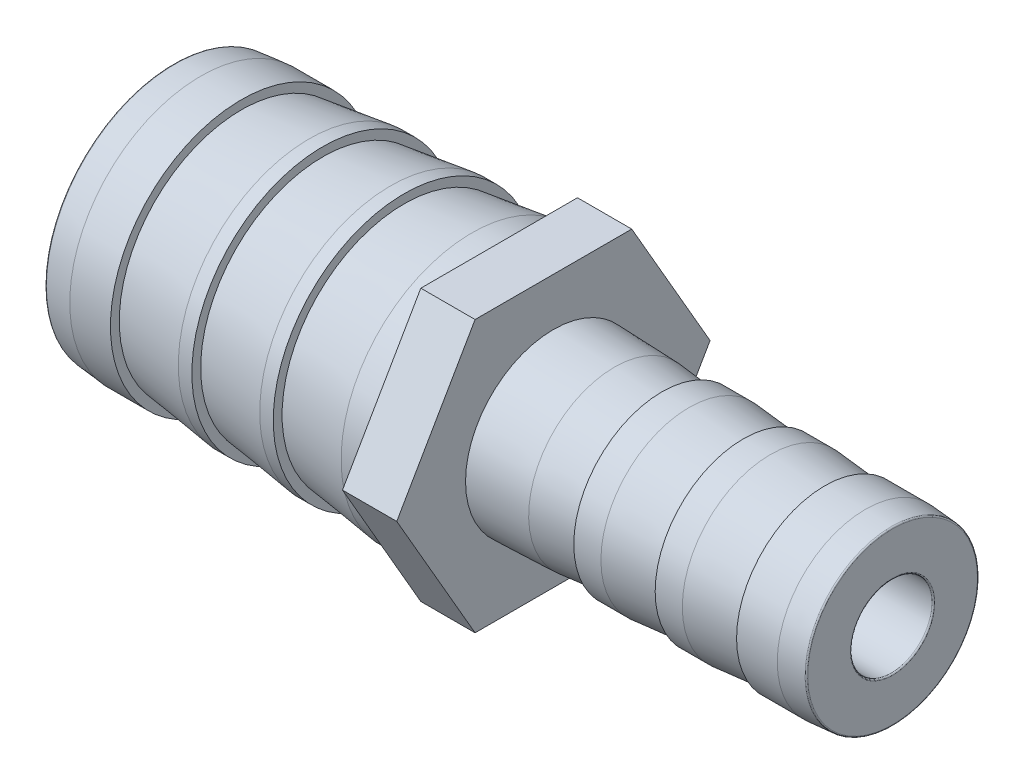
ISO-10303-21;
HEADER;
FILE_DESCRIPTION(('STEP AP214'),'2;1');
FILE_NAME('part.step','',(''),(''),'','','');
FILE_SCHEMA(('AUTOMOTIVE_DESIGN { 1 0 10303 214 1 1 1 1 }'));
ENDSEC;
DATA;
#1=APPLICATION_CONTEXT('core data for automotive mechanical design processes');
#2=APPLICATION_PROTOCOL_DEFINITION('international standard','automotive_design',2000,#1);
#3=PRODUCT_CONTEXT('',#1,'mechanical');
#4=PRODUCT('Part','Part','',(#3));
#5=PRODUCT_RELATED_PRODUCT_CATEGORY('part','',(#4));
#6=PRODUCT_DEFINITION_FORMATION('','',#4);
#7=PRODUCT_DEFINITION_CONTEXT('part definition',#1,'design');
#8=PRODUCT_DEFINITION('design','',#6,#7);
#9=PRODUCT_DEFINITION_SHAPE('','',#8);
#10=(LENGTH_UNIT() NAMED_UNIT(*) SI_UNIT(.MILLI.,.METRE.));
#11=(NAMED_UNIT(*) PLANE_ANGLE_UNIT() SI_UNIT($,.RADIAN.));
#12=(NAMED_UNIT(*) SI_UNIT($,.STERADIAN.) SOLID_ANGLE_UNIT());
#13=UNCERTAINTY_MEASURE_WITH_UNIT(LENGTH_MEASURE(1.E-05),#10,'distance_accuracy_value','');
#14=(GEOMETRIC_REPRESENTATION_CONTEXT(3) GLOBAL_UNCERTAINTY_ASSIGNED_CONTEXT((#13)) GLOBAL_UNIT_ASSIGNED_CONTEXT((#10,
#11,#12)) REPRESENTATION_CONTEXT('',''));
#15=CARTESIAN_POINT('',(0.,0.,0.));
#16=DIRECTION('',(0.,0.,1.));
#17=DIRECTION('',(1.,0.,0.));
#18=AXIS2_PLACEMENT_3D('',#15,#16,#17);
#19=CARTESIAN_POINT('',(-1.58307646517101,-9.2,-5.31162247654456));
#20=DIRECTION('',(0.,-0.5,-0.866025403784439));
#21=DIRECTION('',(0.,0.866025403784439,-0.5));
#22=AXIS2_PLACEMENT_3D('',#19,#20,#21);
#23=PLANE('',#22);
#24=DIRECTION('',(0.,0.866025403784439,-0.5));
#25=VECTOR('',#24,1.);
#26=CARTESIAN_POINT('',(2.09692353482899,-9.2,-5.31162247654456));
#27=LINE('',#26,#25);
#28=CARTESIAN_POINT('',(2.09692353482899,-9.2,-5.31162247654456));
#29=VERTEX_POINT('',#28);
#30=CARTESIAN_POINT('',(2.09692353482899,0.,-10.6232449530891));
#31=VERTEX_POINT('',#30);
#32=EDGE_CURVE('E124',#29,#31,#27,.T.);
#33=ORIENTED_EDGE('',*,*,#32,.F.);
#34=DIRECTION('',(1.,0.,0.));
#35=VECTOR('',#34,1.);
#36=CARTESIAN_POINT('',(-1.58307646517101,-9.2,-5.31162247654456));
#37=LINE('',#36,#35);
#38=CARTESIAN_POINT('',(-1.58307646517101,-9.2,-5.31162247654456));
#39=VERTEX_POINT('',#38);
#40=EDGE_CURVE('E53',#39,#29,#37,.T.);
#41=ORIENTED_EDGE('',*,*,#40,.F.);
#42=DIRECTION('',(0.,0.866025403784439,-0.5));
#43=VECTOR('',#42,1.);
#44=CARTESIAN_POINT('',(-1.58307646517101,-9.2,-5.31162247654456));
#45=LINE('',#44,#43);
#46=CARTESIAN_POINT('',(-1.58307646517101,0.,-10.6232449530891));
#47=VERTEX_POINT('',#46);
#48=EDGE_CURVE('E140',#39,#47,#45,.T.);
#49=ORIENTED_EDGE('',*,*,#48,.T.);
#50=DIRECTION('',(1.,0.,0.));
#51=VECTOR('',#50,1.);
#52=CARTESIAN_POINT('',(-1.58307646517101,0.,-10.6232449530891));
#53=LINE('',#52,#51);
#54=EDGE_CURVE('E88',#47,#31,#53,.T.);
#55=ORIENTED_EDGE('',*,*,#54,.T.);
#56=EDGE_LOOP('',(#33,#41,#49,#55));
#57=FACE_BOUND('',#56,.T.);
#58=ADVANCED_FACE('F36',(#57),#23,.T.);
#59=CARTESIAN_POINT('',(-1.58307646517101,-9.2,5.31162247654456));
#60=DIRECTION('',(0.,-1.,0.));
#61=DIRECTION('',(0.,0.,-1.));
#62=AXIS2_PLACEMENT_3D('',#59,#60,#61);
#63=PLANE('',#62);
#64=DIRECTION('',(0.,0.,-1.));
#65=VECTOR('',#64,1.);
#66=CARTESIAN_POINT('',(2.09692353482899,-9.2,5.31162247654456));
#67=LINE('',#66,#65);
#68=CARTESIAN_POINT('',(2.09692353482899,-9.2,5.31162247654456));
#69=VERTEX_POINT('',#68);
#70=EDGE_CURVE('E137',#69,#29,#67,.T.);
#71=ORIENTED_EDGE('',*,*,#70,.F.);
#72=DIRECTION('',(1.,0.,0.));
#73=VECTOR('',#72,1.);
#74=CARTESIAN_POINT('',(-1.58307646517101,-9.2,5.31162247654456));
#75=LINE('',#74,#73);
#76=CARTESIAN_POINT('',(-1.58307646517101,-9.2,5.31162247654456));
#77=VERTEX_POINT('',#76);
#78=EDGE_CURVE('E76',#77,#69,#75,.T.);
#79=ORIENTED_EDGE('',*,*,#78,.F.);
#80=DIRECTION('',(0.,0.,-1.));
#81=VECTOR('',#80,1.);
#82=CARTESIAN_POINT('',(-1.58307646517101,-9.2,5.31162247654456));
#83=LINE('',#82,#81);
#84=EDGE_CURVE('E114',#77,#39,#83,.T.);
#85=ORIENTED_EDGE('',*,*,#84,.T.);
#86=ORIENTED_EDGE('',*,*,#40,.T.);
#87=EDGE_LOOP('',(#71,#79,#85,#86));
#88=FACE_BOUND('',#87,.T.);
#89=ADVANCED_FACE('F192',(#88),#63,.T.);
#90=CARTESIAN_POINT('',(-1.58307646517101,0.,10.6232449530891));
#91=DIRECTION('',(0.,-0.5,0.866025403784439));
#92=DIRECTION('',(0.,-0.866025403784439,-0.5));
#93=AXIS2_PLACEMENT_3D('',#90,#91,#92);
#94=PLANE('',#93);
#95=DIRECTION('',(0.,-0.866025403784439,-0.5));
#96=VECTOR('',#95,1.);
#97=CARTESIAN_POINT('',(2.09692353482899,0.,10.6232449530891));
#98=LINE('',#97,#96);
#99=CARTESIAN_POINT('',(2.09692353482899,0.,10.6232449530891));
#100=VERTEX_POINT('',#99);
#101=EDGE_CURVE('E101',#100,#69,#98,.T.);
#102=ORIENTED_EDGE('',*,*,#101,.F.);
#103=DIRECTION('',(1.,0.,0.));
#104=VECTOR('',#103,1.);
#105=CARTESIAN_POINT('',(-1.58307646517101,0.,10.6232449530891));
#106=LINE('',#105,#104);
#107=CARTESIAN_POINT('',(-1.58307646517101,0.,10.6232449530891));
#108=VERTEX_POINT('',#107);
#109=EDGE_CURVE('E96',#108,#100,#106,.T.);
#110=ORIENTED_EDGE('',*,*,#109,.F.);
#111=DIRECTION('',(0.,-0.866025403784439,-0.5));
#112=VECTOR('',#111,1.);
#113=CARTESIAN_POINT('',(-1.58307646517101,0.,10.6232449530891));
#114=LINE('',#113,#112);
#115=EDGE_CURVE('E99',#108,#77,#114,.T.);
#116=ORIENTED_EDGE('',*,*,#115,.T.);
#117=ORIENTED_EDGE('',*,*,#78,.T.);
#118=EDGE_LOOP('',(#102,#110,#116,#117));
#119=FACE_BOUND('',#118,.T.);
#120=ADVANCED_FACE('F98',(#119),#94,.T.);
#121=CARTESIAN_POINT('',(-1.58307646517101,9.2,5.31162247654456));
#122=DIRECTION('',(0.,0.5,0.866025403784439));
#123=DIRECTION('',(0.,-0.866025403784439,0.5));
#124=AXIS2_PLACEMENT_3D('',#121,#122,#123);
#125=PLANE('',#124);
#126=DIRECTION('',(0.,-0.866025403784439,0.5));
#127=VECTOR('',#126,1.);
#128=CARTESIAN_POINT('',(2.09692353482899,9.2,5.31162247654456));
#129=LINE('',#128,#127);
#130=CARTESIAN_POINT('',(2.09692353482899,9.2,5.31162247654456));
#131=VERTEX_POINT('',#130);
#132=EDGE_CURVE('E134',#131,#100,#129,.T.);
#133=ORIENTED_EDGE('',*,*,#132,.F.);
#134=DIRECTION('',(1.,0.,0.));
#135=VECTOR('',#134,1.);
#136=CARTESIAN_POINT('',(-1.58307646517101,9.2,5.31162247654456));
#137=LINE('',#136,#135);
#138=CARTESIAN_POINT('',(-1.58307646517101,9.2,5.31162247654456));
#139=VERTEX_POINT('',#138);
#140=EDGE_CURVE('E106',#139,#131,#137,.T.);
#141=ORIENTED_EDGE('',*,*,#140,.F.);
#142=DIRECTION('',(0.,-0.866025403784439,0.5));
#143=VECTOR('',#142,1.);
#144=CARTESIAN_POINT('',(-1.58307646517101,9.2,5.31162247654456));
#145=LINE('',#144,#143);
#146=EDGE_CURVE('E112',#139,#108,#145,.T.);
#147=ORIENTED_EDGE('',*,*,#146,.T.);
#148=ORIENTED_EDGE('',*,*,#109,.T.);
#149=EDGE_LOOP('',(#133,#141,#147,#148));
#150=FACE_BOUND('',#149,.T.);
#151=ADVANCED_FACE('F116',(#150),#125,.T.);
#152=CARTESIAN_POINT('',(-1.58307646517101,9.2,-5.31162247654456));
#153=DIRECTION('',(0.,1.,0.));
#154=DIRECTION('',(0.,0.,1.));
#155=AXIS2_PLACEMENT_3D('',#152,#153,#154);
#156=PLANE('',#155);
#157=DIRECTION('',(0.,0.,1.));
#158=VECTOR('',#157,1.);
#159=CARTESIAN_POINT('',(2.09692353482899,9.2,-5.31162247654456));
#160=LINE('',#159,#158);
#161=CARTESIAN_POINT('',(2.09692353482899,9.2,-5.31162247654456));
#162=VERTEX_POINT('',#161);
#163=EDGE_CURVE('E131',#162,#131,#160,.T.);
#164=ORIENTED_EDGE('',*,*,#163,.F.);
#165=DIRECTION('',(1.,0.,0.));
#166=VECTOR('',#165,1.);
#167=CARTESIAN_POINT('',(-1.58307646517101,9.2,-5.31162247654456));
#168=LINE('',#167,#166);
#169=CARTESIAN_POINT('',(-1.58307646517101,9.2,-5.31162247654456));
#170=VERTEX_POINT('',#169);
#171=EDGE_CURVE('E145',#170,#162,#168,.T.);
#172=ORIENTED_EDGE('',*,*,#171,.F.);
#173=DIRECTION('',(0.,0.,1.));
#174=VECTOR('',#173,1.);
#175=CARTESIAN_POINT('',(-1.58307646517101,9.2,-5.31162247654456));
#176=LINE('',#175,#174);
#177=EDGE_CURVE('E117',#170,#139,#176,.T.);
#178=ORIENTED_EDGE('',*,*,#177,.T.);
#179=ORIENTED_EDGE('',*,*,#140,.T.);
#180=EDGE_LOOP('',(#164,#172,#178,#179));
#181=FACE_BOUND('',#180,.T.);
#182=ADVANCED_FACE('F298',(#181),#156,.T.);
#183=CARTESIAN_POINT('',(-1.58307646517101,0.,-10.6232449530891));
#184=DIRECTION('',(0.,0.5,-0.866025403784439));
#185=DIRECTION('',(0.,0.866025403784439,0.5));
#186=AXIS2_PLACEMENT_3D('',#183,#184,#185);
#187=PLANE('',#186);
#188=DIRECTION('',(0.,0.866025403784439,0.5));
#189=VECTOR('',#188,1.);
#190=CARTESIAN_POINT('',(2.09692353482899,0.,-10.6232449530891));
#191=LINE('',#190,#189);
#192=EDGE_CURVE('E127',#31,#162,#191,.T.);
#193=ORIENTED_EDGE('',*,*,#192,.F.);
#194=ORIENTED_EDGE('',*,*,#54,.F.);
#195=DIRECTION('',(0.,0.866025403784439,0.5));
#196=VECTOR('',#195,1.);
#197=CARTESIAN_POINT('',(-1.58307646517101,0.,-10.6232449530891));
#198=LINE('',#197,#196);
#199=EDGE_CURVE('E119',#47,#170,#198,.T.);
#200=ORIENTED_EDGE('',*,*,#199,.T.);
#201=ORIENTED_EDGE('',*,*,#171,.T.);
#202=EDGE_LOOP('',(#193,#194,#200,#201));
#203=FACE_BOUND('',#202,.T.);
#204=ADVANCED_FACE('F200',(#203),#187,.T.);
#205=CARTESIAN_POINT('',(-1.58307646517101,0.,0.));
#206=DIRECTION('',(1.,0.,0.));
#207=DIRECTION('',(0.,0.,-1.));
#208=AXIS2_PLACEMENT_3D('',#205,#206,#207);
#209=PLANE('',#208);
#210=CARTESIAN_POINT('',(-1.58307646517101,0.,0.));
#211=DIRECTION('',(1.,0.,0.));
#212=DIRECTION('',(0.,0.,-1.));
#213=AXIS2_PLACEMENT_3D('',#210,#211,#212);
#214=CIRCLE('',#213,8.878);
#215=CARTESIAN_POINT('',(-1.58307646517101,0.,-8.878));
#216=VERTEX_POINT('',#215);
#217=EDGE_CURVE('E128',#216,#216,#214,.T.);
#218=ORIENTED_EDGE('',*,*,#217,.T.);
#219=EDGE_LOOP('',(#218));
#220=FACE_BOUND('',#219,.T.);
#221=ORIENTED_EDGE('',*,*,#48,.F.);
#222=ORIENTED_EDGE('',*,*,#84,.F.);
#223=ORIENTED_EDGE('',*,*,#115,.F.);
#224=ORIENTED_EDGE('',*,*,#146,.F.);
#225=ORIENTED_EDGE('',*,*,#177,.F.);
#226=ORIENTED_EDGE('',*,*,#199,.F.);
#227=EDGE_LOOP('',(#221,#222,#223,#224,#225,#226));
#228=FACE_BOUND('',#227,.T.);
#229=ADVANCED_FACE('F110',(#220,#228),#209,.F.);
#230=CARTESIAN_POINT('',(2.09692353482899,0.,0.));
#231=DIRECTION('',(1.,0.,0.));
#232=DIRECTION('',(0.,0.,-1.));
#233=AXIS2_PLACEMENT_3D('',#230,#231,#232);
#234=PLANE('',#233);
#235=CARTESIAN_POINT('',(2.09692353483735,0.,0.));
#236=DIRECTION('',(1.,0.,0.));
#237=DIRECTION('',(0.,1.,0.));
#238=AXIS2_PLACEMENT_3D('',#235,#236,#237);
#239=CIRCLE('',#238,5.95883999999881);
#240=CARTESIAN_POINT('',(2.09692353483735,5.95883999999881,0.));
#241=VERTEX_POINT('',#240);
#242=EDGE_CURVE('E142',#241,#241,#239,.T.);
#243=ORIENTED_EDGE('',*,*,#242,.F.);
#244=EDGE_LOOP('',(#243));
#245=FACE_BOUND('',#244,.T.);
#246=ORIENTED_EDGE('',*,*,#32,.T.);
#247=ORIENTED_EDGE('',*,*,#192,.T.);
#248=ORIENTED_EDGE('',*,*,#163,.T.);
#249=ORIENTED_EDGE('',*,*,#132,.T.);
#250=ORIENTED_EDGE('',*,*,#101,.T.);
#251=ORIENTED_EDGE('',*,*,#70,.T.);
#252=EDGE_LOOP('',(#246,#247,#248,#249,#250,#251));
#253=FACE_BOUND('',#252,.T.);
#254=ADVANCED_FACE('F296',(#245,#253),#234,.T.);
#255=CARTESIAN_POINT('',(-21.823076465171,0.,0.));
#256=DIRECTION('',(1.,0.,0.));
#257=DIRECTION('',(0.,0.,-1.));
#258=AXIS2_PLACEMENT_3D('',#255,#256,#257);
#259=CONICAL_SURFACE('',#258,8.878,0.0996686524911598);
#260=CARTESIAN_POINT('',(-23.580230807321,0.,0.));
#261=DIRECTION('',(-1.,0.,0.));
#262=DIRECTION('',(0.,0.,1.));
#263=AXIS2_PLACEMENT_3D('',#260,#261,#262);
#264=CIRCLE('',#263,8.70228456578501);
#265=CARTESIAN_POINT('',(-23.580230807321,0.,8.70228456578501));
#266=VERTEX_POINT('',#265);
#267=EDGE_CURVE('E11',#266,#266,#264,.F.);
#268=ORIENTED_EDGE('',*,*,#267,.T.);
#269=EDGE_LOOP('',(#268));
#270=FACE_BOUND('',#269,.T.);
#271=CARTESIAN_POINT('',(-21.823076465171,0.,0.));
#272=DIRECTION('',(1.,0.,0.));
#273=DIRECTION('',(0.,0.,-1.));
#274=AXIS2_PLACEMENT_3D('',#271,#272,#273);
#275=CIRCLE('',#274,8.878);
#276=CARTESIAN_POINT('',(-21.823076465171,0.,-8.878));
#277=VERTEX_POINT('',#276);
#278=EDGE_CURVE('E260',#277,#277,#275,.T.);
#279=ORIENTED_EDGE('',*,*,#278,.F.);
#280=EDGE_LOOP('',(#279));
#281=FACE_BOUND('',#280,.T.);
#282=ADVANCED_FACE('F310',(#270,#281),#259,.T.);
#283=CARTESIAN_POINT('',(-23.663076465171,8.694,0.));
#284=DIRECTION('',(-1.,0.,0.));
#285=DIRECTION('',(0.,0.,1.));
#286=AXIS2_PLACEMENT_3D('',#283,#284,#285);
#287=PLANE('',#286);
#288=CARTESIAN_POINT('',(-23.663076465171,0.,0.));
#289=DIRECTION('',(-1.,0.,0.));
#290=DIRECTION('',(0.,0.,1.));
#291=AXIS2_PLACEMENT_3D('',#288,#289,#290);
#292=CIRCLE('',#291,7.82000000000002);
#293=CARTESIAN_POINT('',(-23.663076465171,0.,7.82000000000002));
#294=VERTEX_POINT('',#293);
#295=EDGE_CURVE('E154',#294,#294,#292,.F.);
#296=ORIENTED_EDGE('',*,*,#295,.T.);
#297=EDGE_LOOP('',(#296));
#298=FACE_BOUND('',#297,.T.);
#299=CARTESIAN_POINT('',(-23.663076465171,0.,0.));
#300=DIRECTION('',(-1.,0.,0.));
#301=DIRECTION('',(0.,0.,1.));
#302=AXIS2_PLACEMENT_3D('',#299,#300,#301);
#303=CIRCLE('',#302,8.61074114428569);
#304=CARTESIAN_POINT('',(-23.663076465171,0.,8.61074114428569));
#305=VERTEX_POINT('',#304);
#306=EDGE_CURVE('E151',#305,#305,#303,.T.);
#307=ORIENTED_EDGE('',*,*,#306,.T.);
#308=EDGE_LOOP('',(#307));
#309=FACE_BOUND('',#308,.T.);
#310=ADVANCED_FACE('F317',(#298,#309),#287,.T.);
#311=CARTESIAN_POINT('',(-23.663076465171,0.,0.));
#312=DIRECTION('',(1.,0.,0.));
#313=DIRECTION('',(0.,0.,-1.));
#314=AXIS2_PLACEMENT_3D('',#311,#312,#313);
#315=CYLINDRICAL_SURFACE('',#314,8.878);
#316=CARTESIAN_POINT('',(-3.42307646517102,0.,0.));
#317=DIRECTION('',(1.,0.,0.));
#318=DIRECTION('',(0.,0.,-1.));
#319=AXIS2_PLACEMENT_3D('',#316,#317,#318);
#320=CIRCLE('',#319,8.878);
#321=CARTESIAN_POINT('',(-3.42307646517102,0.,-8.878));
#322=VERTEX_POINT('',#321);
#323=EDGE_CURVE('E289',#322,#322,#320,.T.);
#324=ORIENTED_EDGE('',*,*,#323,.T.);
#325=EDGE_LOOP('',(#324));
#326=FACE_BOUND('',#325,.T.);
#327=ORIENTED_EDGE('',*,*,#217,.F.);
#328=EDGE_LOOP('',(#327));
#329=FACE_BOUND('',#328,.T.);
#330=ADVANCED_FACE('F321',(#326,#329),#315,.T.);
#331=CARTESIAN_POINT('',(-3.42307646517102,0.,0.));
#332=DIRECTION('',(1.,0.,0.));
#333=DIRECTION('',(0.,0.,-1.));
#334=AXIS2_PLACEMENT_3D('',#331,#332,#333);
#335=CONICAL_SURFACE('',#334,8.878,0.129275004048144);
#336=CARTESIAN_POINT('',(-8.02307646517099,0.,0.));
#337=DIRECTION('',(1.,0.,0.));
#338=DIRECTION('',(0.,0.,-1.));
#339=AXIS2_PLACEMENT_3D('',#336,#337,#338);
#340=CIRCLE('',#339,8.28);
#341=CARTESIAN_POINT('',(-8.02307646517099,0.,-8.28));
#342=VERTEX_POINT('',#341);
#343=EDGE_CURVE('E286',#342,#342,#340,.T.);
#344=ORIENTED_EDGE('',*,*,#343,.T.);
#345=EDGE_LOOP('',(#344));
#346=FACE_BOUND('',#345,.T.);
#347=ORIENTED_EDGE('',*,*,#323,.F.);
#348=EDGE_LOOP('',(#347));
#349=FACE_BOUND('',#348,.T.);
#350=ADVANCED_FACE('F325',(#346,#349),#335,.T.);
#351=CARTESIAN_POINT('',(-8.02307646517101,8.28,0.));
#352=DIRECTION('',(1.,0.,0.));
#353=DIRECTION('',(0.,0.,-1.));
#354=AXIS2_PLACEMENT_3D('',#351,#352,#353);
#355=PLANE('',#354);
#356=CARTESIAN_POINT('',(-8.02307646517101,0.,0.));
#357=DIRECTION('',(1.,0.,0.));
#358=DIRECTION('',(0.,0.,-1.));
#359=AXIS2_PLACEMENT_3D('',#356,#357,#358);
#360=CIRCLE('',#359,8.878);
#361=CARTESIAN_POINT('',(-8.02307646517101,0.,-8.878));
#362=VERTEX_POINT('',#361);
#363=EDGE_CURVE('E283',#362,#362,#360,.T.);
#364=ORIENTED_EDGE('',*,*,#363,.T.);
#365=EDGE_LOOP('',(#364));
#366=FACE_BOUND('',#365,.T.);
#367=ORIENTED_EDGE('',*,*,#343,.F.);
#368=EDGE_LOOP('',(#367));
#369=FACE_BOUND('',#368,.T.);
#370=ADVANCED_FACE('F329',(#366,#369),#355,.T.);
#371=CARTESIAN_POINT('',(-23.663076465171,0.,0.));
#372=DIRECTION('',(1.,0.,0.));
#373=DIRECTION('',(0.,0.,-1.));
#374=AXIS2_PLACEMENT_3D('',#371,#372,#373);
#375=CYLINDRICAL_SURFACE('',#374,8.878);
#376=CARTESIAN_POINT('',(-8.94307646517101,0.,0.));
#377=DIRECTION('',(1.,0.,0.));
#378=DIRECTION('',(0.,0.,-1.));
#379=AXIS2_PLACEMENT_3D('',#376,#377,#378);
#380=CIRCLE('',#379,8.878);
#381=CARTESIAN_POINT('',(-8.94307646517101,0.,-8.878));
#382=VERTEX_POINT('',#381);
#383=EDGE_CURVE('E280',#382,#382,#380,.T.);
#384=ORIENTED_EDGE('',*,*,#383,.T.);
#385=EDGE_LOOP('',(#384));
#386=FACE_BOUND('',#385,.T.);
#387=ORIENTED_EDGE('',*,*,#363,.F.);
#388=EDGE_LOOP('',(#387));
#389=FACE_BOUND('',#388,.T.);
#390=ADVANCED_FACE('F333',(#386,#389),#375,.T.);
#391=CARTESIAN_POINT('',(-8.94307646517101,0.,0.));
#392=DIRECTION('',(1.,0.,0.));
#393=DIRECTION('',(0.,0.,-1.));
#394=AXIS2_PLACEMENT_3D('',#391,#392,#393);
#395=CONICAL_SURFACE('',#394,8.878,0.129275004048144);
#396=CARTESIAN_POINT('',(-13.543076465171,0.,0.));
#397=DIRECTION('',(1.,0.,0.));
#398=DIRECTION('',(0.,0.,-1.));
#399=AXIS2_PLACEMENT_3D('',#396,#397,#398);
#400=CIRCLE('',#399,8.28);
#401=CARTESIAN_POINT('',(-13.543076465171,0.,-8.28));
#402=VERTEX_POINT('',#401);
#403=EDGE_CURVE('E277',#402,#402,#400,.T.);
#404=ORIENTED_EDGE('',*,*,#403,.T.);
#405=EDGE_LOOP('',(#404));
#406=FACE_BOUND('',#405,.T.);
#407=ORIENTED_EDGE('',*,*,#383,.F.);
#408=EDGE_LOOP('',(#407));
#409=FACE_BOUND('',#408,.T.);
#410=ADVANCED_FACE('F337',(#406,#409),#395,.T.);
#411=CARTESIAN_POINT('',(-13.543076465171,8.28,0.));
#412=DIRECTION('',(1.,0.,0.));
#413=DIRECTION('',(0.,0.,-1.));
#414=AXIS2_PLACEMENT_3D('',#411,#412,#413);
#415=PLANE('',#414);
#416=CARTESIAN_POINT('',(-13.543076465171,0.,0.));
#417=DIRECTION('',(1.,0.,0.));
#418=DIRECTION('',(0.,0.,-1.));
#419=AXIS2_PLACEMENT_3D('',#416,#417,#418);
#420=CIRCLE('',#419,8.878);
#421=CARTESIAN_POINT('',(-13.543076465171,0.,-8.878));
#422=VERTEX_POINT('',#421);
#423=EDGE_CURVE('E274',#422,#422,#420,.T.);
#424=ORIENTED_EDGE('',*,*,#423,.T.);
#425=EDGE_LOOP('',(#424));
#426=FACE_BOUND('',#425,.T.);
#427=ORIENTED_EDGE('',*,*,#403,.F.);
#428=EDGE_LOOP('',(#427));
#429=FACE_BOUND('',#428,.T.);
#430=ADVANCED_FACE('F341',(#426,#429),#415,.T.);
#431=CARTESIAN_POINT('',(-23.663076465171,0.,0.));
#432=DIRECTION('',(1.,0.,0.));
#433=DIRECTION('',(0.,0.,-1.));
#434=AXIS2_PLACEMENT_3D('',#431,#432,#433);
#435=CYLINDRICAL_SURFACE('',#434,8.878);
#436=CARTESIAN_POINT('',(-14.463076465171,0.,0.));
#437=DIRECTION('',(1.,0.,0.));
#438=DIRECTION('',(0.,0.,-1.));
#439=AXIS2_PLACEMENT_3D('',#436,#437,#438);
#440=CIRCLE('',#439,8.878);
#441=CARTESIAN_POINT('',(-14.463076465171,0.,-8.878));
#442=VERTEX_POINT('',#441);
#443=EDGE_CURVE('E271',#442,#442,#440,.T.);
#444=ORIENTED_EDGE('',*,*,#443,.T.);
#445=EDGE_LOOP('',(#444));
#446=FACE_BOUND('',#445,.T.);
#447=ORIENTED_EDGE('',*,*,#423,.F.);
#448=EDGE_LOOP('',(#447));
#449=FACE_BOUND('',#448,.T.);
#450=ADVANCED_FACE('F345',(#446,#449),#435,.T.);
#451=CARTESIAN_POINT('',(-14.463076465171,0.,0.));
#452=DIRECTION('',(1.,0.,0.));
#453=DIRECTION('',(0.,0.,-1.));
#454=AXIS2_PLACEMENT_3D('',#451,#452,#453);
#455=CONICAL_SURFACE('',#454,8.878,0.129275004048143);
#456=CARTESIAN_POINT('',(-19.063076465171,0.,0.));
#457=DIRECTION('',(1.,0.,0.));
#458=DIRECTION('',(0.,0.,-1.));
#459=AXIS2_PLACEMENT_3D('',#456,#457,#458);
#460=CIRCLE('',#459,8.28);
#461=CARTESIAN_POINT('',(-19.063076465171,0.,-8.28));
#462=VERTEX_POINT('',#461);
#463=EDGE_CURVE('E268',#462,#462,#460,.T.);
#464=ORIENTED_EDGE('',*,*,#463,.T.);
#465=EDGE_LOOP('',(#464));
#466=FACE_BOUND('',#465,.T.);
#467=ORIENTED_EDGE('',*,*,#443,.F.);
#468=EDGE_LOOP('',(#467));
#469=FACE_BOUND('',#468,.T.);
#470=ADVANCED_FACE('F349',(#466,#469),#455,.T.);
#471=CARTESIAN_POINT('',(-19.063076465171,8.28,0.));
#472=DIRECTION('',(1.,0.,0.));
#473=DIRECTION('',(0.,0.,-1.));
#474=AXIS2_PLACEMENT_3D('',#471,#472,#473);
#475=PLANE('',#474);
#476=CARTESIAN_POINT('',(-19.063076465171,0.,0.));
#477=DIRECTION('',(1.,0.,0.));
#478=DIRECTION('',(0.,0.,-1.));
#479=AXIS2_PLACEMENT_3D('',#476,#477,#478);
#480=CIRCLE('',#479,8.878);
#481=CARTESIAN_POINT('',(-19.063076465171,0.,-8.878));
#482=VERTEX_POINT('',#481);
#483=EDGE_CURVE('E265',#482,#482,#480,.T.);
#484=ORIENTED_EDGE('',*,*,#483,.T.);
#485=EDGE_LOOP('',(#484));
#486=FACE_BOUND('',#485,.T.);
#487=ORIENTED_EDGE('',*,*,#463,.F.);
#488=EDGE_LOOP('',(#487));
#489=FACE_BOUND('',#488,.T.);
#490=ADVANCED_FACE('F353',(#486,#489),#475,.T.);
#491=CARTESIAN_POINT('',(-23.663076465171,0.,0.));
#492=DIRECTION('',(1.,0.,0.));
#493=DIRECTION('',(0.,0.,-1.));
#494=AXIS2_PLACEMENT_3D('',#491,#492,#493);
#495=CYLINDRICAL_SURFACE('',#494,8.878);
#496=ORIENTED_EDGE('',*,*,#278,.T.);
#497=EDGE_LOOP('',(#496));
#498=FACE_BOUND('',#497,.T.);
#499=ORIENTED_EDGE('',*,*,#483,.F.);
#500=EDGE_LOOP('',(#499));
#501=FACE_BOUND('',#500,.T.);
#502=ADVANCED_FACE('F188',(#498,#501),#495,.T.);
#503=CARTESIAN_POINT('',(6.23692353485283,0.,0.));
#504=DIRECTION('',(-1.,0.,0.));
#505=DIRECTION('',(0.,-1.,0.));
#506=AXIS2_PLACEMENT_3D('',#503,#504,#505);
#507=CONICAL_SURFACE('',#506,5.82083999999895,0.0333209958780892);
#508=ORIENTED_EDGE('',*,*,#242,.T.);
#509=EDGE_LOOP('',(#508));
#510=FACE_BOUND('',#509,.T.);
#511=CARTESIAN_POINT('',(6.23692353485283,0.,0.));
#512=DIRECTION('',(1.,0.,0.));
#513=DIRECTION('',(0.,1.,0.));
#514=AXIS2_PLACEMENT_3D('',#511,#512,#513);
#515=CIRCLE('',#514,5.82083999999895);
#516=CARTESIAN_POINT('',(6.23692353485283,5.82083999999895,0.));
#517=VERTEX_POINT('',#516);
#518=EDGE_CURVE('E225',#517,#517,#515,.T.);
#519=ORIENTED_EDGE('',*,*,#518,.F.);
#520=EDGE_LOOP('',(#519));
#521=FACE_BOUND('',#520,.T.);
#522=ADVANCED_FACE('F179',(#510,#521),#507,.T.);
#523=CARTESIAN_POINT('',(25.096923534829,0.,0.));
#524=DIRECTION('',(1.,0.,0.));
#525=DIRECTION('',(0.,1.,0.));
#526=AXIS2_PLACEMENT_3D('',#523,#524,#525);
#527=PLANE('',#526);
#528=CARTESIAN_POINT('',(25.096923534829,0.,0.));
#529=DIRECTION('',(1.,0.,0.));
#530=DIRECTION('',(0.,1.,0.));
#531=AXIS2_PLACEMENT_3D('',#528,#529,#530);
#532=CIRCLE('',#531,2.85200000000002);
#533=CARTESIAN_POINT('',(25.096923534829,2.85200000000002,0.));
#534=VERTEX_POINT('',#533);
#535=EDGE_CURVE('E160',#534,#534,#532,.F.);
#536=ORIENTED_EDGE('',*,*,#535,.T.);
#537=EDGE_LOOP('',(#536));
#538=FACE_BOUND('',#537,.T.);
#539=CARTESIAN_POINT('',(25.096923534829,0.,0.));
#540=DIRECTION('',(1.,0.,0.));
#541=DIRECTION('',(0.,1.,0.));
#542=AXIS2_PLACEMENT_3D('',#539,#540,#541);
#543=CIRCLE('',#542,5.75664161284319);
#544=CARTESIAN_POINT('',(25.096923534829,5.75664161284319,0.));
#545=VERTEX_POINT('',#544);
#546=EDGE_CURVE('E157',#545,#545,#543,.T.);
#547=ORIENTED_EDGE('',*,*,#546,.T.);
#548=EDGE_LOOP('',(#547));
#549=FACE_BOUND('',#548,.T.);
#550=ADVANCED_FACE('F177',(#538,#549),#527,.T.);
#551=CARTESIAN_POINT('',(25.096923534829,0.,0.));
#552=DIRECTION('',(-1.,0.,0.));
#553=DIRECTION('',(0.,-1.,0.));
#554=AXIS2_PLACEMENT_3D('',#551,#552,#553);
#555=CONICAL_SURFACE('',#554,5.84199999999567,0.0748598477122581);
#556=CARTESIAN_POINT('',(25.0118042100674,0.,0.));
#557=DIRECTION('',(1.,0.,0.));
#558=DIRECTION('',(0.,1.,0.));
#559=AXIS2_PLACEMENT_3D('',#556,#557,#558);
#560=CIRCLE('',#559,5.84838394935292);
#561=CARTESIAN_POINT('',(25.0118042100674,5.84838394935292,0.));
#562=VERTEX_POINT('',#561);
#563=EDGE_CURVE('E45',#562,#562,#560,.F.);
#564=ORIENTED_EDGE('',*,*,#563,.T.);
#565=EDGE_LOOP('',(#564));
#566=FACE_BOUND('',#565,.T.);
#567=CARTESIAN_POINT('',(23.2569235348081,0.,0.));
#568=DIRECTION('',(1.,0.,0.));
#569=DIRECTION('',(0.,1.,0.));
#570=AXIS2_PLACEMENT_3D('',#567,#568,#569);
#571=CIRCLE('',#570,5.98);
#572=CARTESIAN_POINT('',(23.2569235348081,5.98,0.));
#573=VERTEX_POINT('',#572);
#574=EDGE_CURVE('E257',#573,#573,#571,.T.);
#575=ORIENTED_EDGE('',*,*,#574,.T.);
#576=EDGE_LOOP('',(#575));
#577=FACE_BOUND('',#576,.T.);
#578=ADVANCED_FACE('F168',(#566,#577),#555,.T.);
#579=CARTESIAN_POINT('',(2.09692353483735,0.,0.));
#580=DIRECTION('',(1.,0.,0.));
#581=DIRECTION('',(0.,1.,0.));
#582=AXIS2_PLACEMENT_3D('',#579,#580,#581);
#583=CYLINDRICAL_SURFACE('',#582,5.98);
#584=CARTESIAN_POINT('',(20.4969235348211,0.,0.));
#585=DIRECTION('',(1.,0.,0.));
#586=DIRECTION('',(0.,1.,0.));
#587=AXIS2_PLACEMENT_3D('',#584,#585,#586);
#588=CIRCLE('',#587,5.98);
#589=CARTESIAN_POINT('',(20.4969235348211,5.98,0.));
#590=VERTEX_POINT('',#589);
#591=EDGE_CURVE('E254',#590,#590,#588,.T.);
#592=ORIENTED_EDGE('',*,*,#591,.T.);
#593=EDGE_LOOP('',(#592));
#594=FACE_BOUND('',#593,.T.);
#595=ORIENTED_EDGE('',*,*,#574,.F.);
#596=EDGE_LOOP('',(#595));
#597=FACE_BOUND('',#596,.T.);
#598=ADVANCED_FACE('F186',(#594,#597),#583,.T.);
#599=CARTESIAN_POINT('',(20.4969235348211,5.98,0.));
#600=DIRECTION('',(-1.,0.,0.));
#601=DIRECTION('',(0.,-1.,0.));
#602=AXIS2_PLACEMENT_3D('',#599,#600,#601);
#603=PLANE('',#602);
#604=CARTESIAN_POINT('',(20.4969235348211,0.,0.));
#605=DIRECTION('',(1.,0.,0.));
#606=DIRECTION('',(0.,1.,0.));
#607=AXIS2_PLACEMENT_3D('',#604,#605,#606);
#608=CIRCLE('',#607,5.65800000000544);
#609=CARTESIAN_POINT('',(20.4969235348211,5.65800000000544,0.));
#610=VERTEX_POINT('',#609);
#611=EDGE_CURVE('E251',#610,#610,#608,.T.);
#612=ORIENTED_EDGE('',*,*,#611,.T.);
#613=EDGE_LOOP('',(#612));
#614=FACE_BOUND('',#613,.T.);
#615=ORIENTED_EDGE('',*,*,#591,.F.);
#616=EDGE_LOOP('',(#615));
#617=FACE_BOUND('',#616,.T.);
#618=ADVANCED_FACE('F409',(#614,#617),#603,.T.);
#619=CARTESIAN_POINT('',(20.4969235348211,0.,0.));
#620=DIRECTION('',(-1.,0.,0.));
#621=DIRECTION('',(0.,-1.,0.));
#622=AXIS2_PLACEMENT_3D('',#619,#620,#621);
#623=CONICAL_SURFACE('',#622,5.65800000000544,0.0872777129475775);
#624=CARTESIAN_POINT('',(16.8169235348035,0.,0.));
#625=DIRECTION('',(1.,0.,0.));
#626=DIRECTION('',(0.,1.,0.));
#627=AXIS2_PLACEMENT_3D('',#624,#625,#626);
#628=CIRCLE('',#627,5.98);
#629=CARTESIAN_POINT('',(16.8169235348035,5.98,0.));
#630=VERTEX_POINT('',#629);
#631=EDGE_CURVE('E248',#630,#630,#628,.T.);
#632=ORIENTED_EDGE('',*,*,#631,.T.);
#633=EDGE_LOOP('',(#632));
#634=FACE_BOUND('',#633,.T.);
#635=ORIENTED_EDGE('',*,*,#611,.F.);
#636=EDGE_LOOP('',(#635));
#637=FACE_BOUND('',#636,.T.);
#638=ADVANCED_FACE('F419',(#634,#637),#623,.T.);
#639=CARTESIAN_POINT('',(2.09692353483735,0.,0.));
#640=DIRECTION('',(1.,0.,0.));
#641=DIRECTION('',(0.,1.,0.));
#642=AXIS2_PLACEMENT_3D('',#639,#640,#641);
#643=CYLINDRICAL_SURFACE('',#642,5.98);
#644=CARTESIAN_POINT('',(14.976923534847,0.,0.));
#645=DIRECTION('',(1.,0.,0.));
#646=DIRECTION('',(0.,1.,0.));
#647=AXIS2_PLACEMENT_3D('',#644,#645,#646);
#648=CIRCLE('',#647,5.98);
#649=CARTESIAN_POINT('',(14.976923534847,5.98,0.));
#650=VERTEX_POINT('',#649);
#651=EDGE_CURVE('E245',#650,#650,#648,.T.);
#652=ORIENTED_EDGE('',*,*,#651,.T.);
#653=EDGE_LOOP('',(#652));
#654=FACE_BOUND('',#653,.T.);
#655=ORIENTED_EDGE('',*,*,#631,.F.);
#656=EDGE_LOOP('',(#655));
#657=FACE_BOUND('',#656,.T.);
#658=ADVANCED_FACE('F429',(#654,#657),#643,.T.);
#659=CARTESIAN_POINT('',(14.976923534847,5.98,0.));
#660=DIRECTION('',(-1.,0.,0.));
#661=DIRECTION('',(0.,-1.,0.));
#662=AXIS2_PLACEMENT_3D('',#659,#660,#661);
#663=PLANE('',#662);
#664=CARTESIAN_POINT('',(14.976923534847,0.,0.));
#665=DIRECTION('',(1.,0.,0.));
#666=DIRECTION('',(0.,1.,0.));
#667=AXIS2_PLACEMENT_3D('',#664,#665,#666);
#668=CIRCLE('',#667,5.65799999999891);
#669=CARTESIAN_POINT('',(14.976923534847,5.65799999999891,0.));
#670=VERTEX_POINT('',#669);
#671=EDGE_CURVE('E242',#670,#670,#668,.T.);
#672=ORIENTED_EDGE('',*,*,#671,.T.);
#673=EDGE_LOOP('',(#672));
#674=FACE_BOUND('',#673,.T.);
#675=ORIENTED_EDGE('',*,*,#651,.F.);
#676=EDGE_LOOP('',(#675));
#677=FACE_BOUND('',#676,.T.);
#678=ADVANCED_FACE('F439',(#674,#677),#663,.T.);
#679=CARTESIAN_POINT('',(14.976923534847,0.,0.));
#680=DIRECTION('',(-1.,0.,0.));
#681=DIRECTION('',(0.,-1.,0.));
#682=AXIS2_PLACEMENT_3D('',#679,#680,#681);
#683=CONICAL_SURFACE('',#682,5.65799999999891,0.0872777129493407);
#684=CARTESIAN_POINT('',(11.2969235348294,0.,0.));
#685=DIRECTION('',(1.,0.,0.));
#686=DIRECTION('',(0.,1.,0.));
#687=AXIS2_PLACEMENT_3D('',#684,#685,#686);
#688=CIRCLE('',#687,5.98);
#689=CARTESIAN_POINT('',(11.2969235348294,5.98,0.));
#690=VERTEX_POINT('',#689);
#691=EDGE_CURVE('E239',#690,#690,#688,.T.);
#692=ORIENTED_EDGE('',*,*,#691,.T.);
#693=EDGE_LOOP('',(#692));
#694=FACE_BOUND('',#693,.T.);
#695=ORIENTED_EDGE('',*,*,#671,.F.);
#696=EDGE_LOOP('',(#695));
#697=FACE_BOUND('',#696,.T.);
#698=ADVANCED_FACE('F449',(#694,#697),#683,.T.);
#699=CARTESIAN_POINT('',(2.09692353483735,0.,0.));
#700=DIRECTION('',(1.,0.,0.));
#701=DIRECTION('',(0.,1.,0.));
#702=AXIS2_PLACEMENT_3D('',#699,#700,#701);
#703=CYLINDRICAL_SURFACE('',#702,5.98);
#704=CARTESIAN_POINT('',(9.45692353482899,0.,0.));
#705=DIRECTION('',(1.,0.,0.));
#706=DIRECTION('',(0.,1.,0.));
#707=AXIS2_PLACEMENT_3D('',#704,#705,#706);
#708=CIRCLE('',#707,5.98);
#709=CARTESIAN_POINT('',(9.45692353482899,5.98,0.));
#710=VERTEX_POINT('',#709);
#711=EDGE_CURVE('E236',#710,#710,#708,.T.);
#712=ORIENTED_EDGE('',*,*,#711,.T.);
#713=EDGE_LOOP('',(#712));
#714=FACE_BOUND('',#713,.T.);
#715=ORIENTED_EDGE('',*,*,#691,.F.);
#716=EDGE_LOOP('',(#715));
#717=FACE_BOUND('',#716,.T.);
#718=ADVANCED_FACE('F459',(#714,#717),#703,.T.);
#719=CARTESIAN_POINT('',(9.45692353482899,5.98,0.));
#720=DIRECTION('',(-1.,0.,0.));
#721=DIRECTION('',(0.,-1.,0.));
#722=AXIS2_PLACEMENT_3D('',#719,#720,#721);
#723=PLANE('',#722);
#724=CARTESIAN_POINT('',(9.45692353482899,0.,0.));
#725=DIRECTION('',(1.,0.,0.));
#726=DIRECTION('',(0.,1.,0.));
#727=AXIS2_PLACEMENT_3D('',#724,#725,#726);
#728=CIRCLE('',#727,5.49884000000134);
#729=CARTESIAN_POINT('',(9.45692353482899,5.49884000000134,0.));
#730=VERTEX_POINT('',#729);
#731=EDGE_CURVE('E229',#730,#730,#728,.T.);
#732=ORIENTED_EDGE('',*,*,#731,.T.);
#733=EDGE_LOOP('',(#732));
#734=FACE_BOUND('',#733,.T.);
#735=ORIENTED_EDGE('',*,*,#711,.F.);
#736=EDGE_LOOP('',(#735));
#737=FACE_BOUND('',#736,.T.);
#738=ADVANCED_FACE('F469',(#734,#737),#723,.T.);
#739=CARTESIAN_POINT('',(9.45692353482899,0.,0.));
#740=DIRECTION('',(-1.,0.,0.));
#741=DIRECTION('',(0.,-1.,0.));
#742=AXIS2_PLACEMENT_3D('',#739,#740,#741);
#743=CONICAL_SURFACE('',#742,5.49884000000134,0.0996686524911624);
#744=ORIENTED_EDGE('',*,*,#518,.T.);
#745=EDGE_LOOP('',(#744));
#746=FACE_BOUND('',#745,.T.);
#747=ORIENTED_EDGE('',*,*,#731,.F.);
#748=EDGE_LOOP('',(#747));
#749=FACE_BOUND('',#748,.T.);
#750=ADVANCED_FACE('F219',(#746,#749),#743,.T.);
#751=CARTESIAN_POINT('',(-23.663076465171,0.,0.));
#752=DIRECTION('',(-1.,0.,0.));
#753=DIRECTION('',(0.,0.,1.));
#754=AXIS2_PLACEMENT_3D('',#751,#752,#753);
#755=CYLINDRICAL_SURFACE('',#754,2.76000000000002);
#756=CARTESIAN_POINT('',(25.004923534829,0.,0.));
#757=DIRECTION('',(1.,0.,0.));
#758=DIRECTION('',(0.,1.,0.));
#759=AXIS2_PLACEMENT_3D('',#756,#757,#758);
#760=CIRCLE('',#759,2.76000000000002);
#761=CARTESIAN_POINT('',(25.004923534829,2.76000000000002,0.));
#762=VERTEX_POINT('',#761);
#763=EDGE_CURVE('E163',#762,#762,#760,.T.);
#764=ORIENTED_EDGE('',*,*,#763,.T.);
#765=EDGE_LOOP('',(#764));
#766=FACE_BOUND('',#765,.T.);
#767=CARTESIAN_POINT('',(-1.58307646517102,0.,0.));
#768=DIRECTION('',(-1.,0.,0.));
#769=DIRECTION('',(0.,0.,1.));
#770=AXIS2_PLACEMENT_3D('',#767,#768,#769);
#771=CIRCLE('',#770,2.76000000000002);
#772=CARTESIAN_POINT('',(-1.58307646517102,0.,2.76000000000002));
#773=VERTEX_POINT('',#772);
#774=EDGE_CURVE('E223',#773,#773,#771,.T.);
#775=ORIENTED_EDGE('',*,*,#774,.T.);
#776=EDGE_LOOP('',(#775));
#777=FACE_BOUND('',#776,.T.);
#778=ADVANCED_FACE('F215',(#766,#777),#755,.F.);
#779=CARTESIAN_POINT('',(-1.58307646517102,2.76000000000002,0.));
#780=DIRECTION('',(1.,0.,0.));
#781=DIRECTION('',(0.,0.,-1.));
#782=AXIS2_PLACEMENT_3D('',#779,#780,#781);
#783=PLANE('',#782);
#784=ORIENTED_EDGE('',*,*,#774,.F.);
#785=EDGE_LOOP('',(#784));
#786=FACE_BOUND('',#785,.T.);
#787=CARTESIAN_POINT('',(-1.58307646517102,0.,0.));
#788=DIRECTION('',(-1.,0.,0.));
#789=DIRECTION('',(0.,0.,1.));
#790=AXIS2_PLACEMENT_3D('',#787,#788,#789);
#791=CIRCLE('',#790,7.72800000000002);
#792=CARTESIAN_POINT('',(-1.58307646517102,0.,7.72800000000002));
#793=VERTEX_POINT('',#792);
#794=EDGE_CURVE('E226',#793,#793,#791,.T.);
#795=ORIENTED_EDGE('',*,*,#794,.T.);
#796=EDGE_LOOP('',(#795));
#797=FACE_BOUND('',#796,.T.);
#798=ADVANCED_FACE('F218',(#786,#797),#783,.F.);
#799=CARTESIAN_POINT('',(-23.663076465171,0.,0.));
#800=DIRECTION('',(-1.,0.,0.));
#801=DIRECTION('',(0.,0.,1.));
#802=AXIS2_PLACEMENT_3D('',#799,#800,#801);
#803=CYLINDRICAL_SURFACE('',#802,7.72800000000002);
#804=CARTESIAN_POINT('',(-23.571076465171,0.,0.));
#805=DIRECTION('',(-1.,0.,0.));
#806=DIRECTION('',(0.,0.,1.));
#807=AXIS2_PLACEMENT_3D('',#804,#805,#806);
#808=CIRCLE('',#807,7.72800000000002);
#809=CARTESIAN_POINT('',(-23.571076465171,0.,7.72800000000002));
#810=VERTEX_POINT('',#809);
#811=EDGE_CURVE('E148',#810,#810,#808,.T.);
#812=ORIENTED_EDGE('',*,*,#811,.T.);
#813=EDGE_LOOP('',(#812));
#814=FACE_BOUND('',#813,.T.);
#815=ORIENTED_EDGE('',*,*,#794,.F.);
#816=EDGE_LOOP('',(#815));
#817=FACE_BOUND('',#816,.T.);
#818=ADVANCED_FACE('F205',(#814,#817),#803,.F.);
#819=CARTESIAN_POINT('',(-23.571076465171,0.,0.));
#820=DIRECTION('',(-1.,0.,0.));
#821=DIRECTION('',(0.,0.,1.));
#822=AXIS2_PLACEMENT_3D('',#819,#820,#821);
#823=TOROIDAL_SURFACE('',#822,7.82000000000002,0.0920000000000002);
#824=ORIENTED_EDGE('',*,*,#295,.F.);
#825=EDGE_LOOP('',(#824));
#826=FACE_BOUND('',#825,.T.);
#827=ORIENTED_EDGE('',*,*,#811,.F.);
#828=EDGE_LOOP('',(#827));
#829=FACE_BOUND('',#828,.T.);
#830=ADVANCED_FACE('F202',(#826,#829),#823,.T.);
#831=CARTESIAN_POINT('',(25.004923534829,0.,0.));
#832=DIRECTION('',(1.,0.,0.));
#833=DIRECTION('',(0.,1.,0.));
#834=AXIS2_PLACEMENT_3D('',#831,#832,#833);
#835=TOROIDAL_SURFACE('',#834,2.85200000000002,0.0920000000000002);
#836=ORIENTED_EDGE('',*,*,#763,.F.);
#837=EDGE_LOOP('',(#836));
#838=FACE_BOUND('',#837,.T.);
#839=ORIENTED_EDGE('',*,*,#535,.F.);
#840=EDGE_LOOP('',(#839));
#841=FACE_BOUND('',#840,.T.);
#842=ADVANCED_FACE('F174',(#838,#841),#835,.T.);
#843=CARTESIAN_POINT('',(25.004923534829,0.,0.));
#844=DIRECTION('',(1.,0.,0.));
#845=DIRECTION('',(0.,1.,0.));
#846=AXIS2_PLACEMENT_3D('',#843,#844,#845);
#847=TOROIDAL_SURFACE('',#846,5.75664161284319,0.0920000000000002);
#848=ORIENTED_EDGE('',*,*,#563,.F.);
#849=EDGE_LOOP('',(#848));
#850=FACE_BOUND('',#849,.T.);
#851=ORIENTED_EDGE('',*,*,#546,.F.);
#852=EDGE_LOOP('',(#851));
#853=FACE_BOUND('',#852,.T.);
#854=ADVANCED_FACE('F171',(#850,#853),#847,.T.);
#855=CARTESIAN_POINT('',(-23.571076465171,0.,0.));
#856=DIRECTION('',(-1.,0.,0.));
#857=DIRECTION('',(0.,0.,1.));
#858=AXIS2_PLACEMENT_3D('',#855,#856,#857);
#859=TOROIDAL_SURFACE('',#858,8.61074114428569,0.0920000000000002);
#860=ORIENTED_EDGE('',*,*,#306,.F.);
#861=EDGE_LOOP('',(#860));
#862=FACE_BOUND('',#861,.T.);
#863=ORIENTED_EDGE('',*,*,#267,.F.);
#864=EDGE_LOOP('',(#863));
#865=FACE_BOUND('',#864,.T.);
#866=ADVANCED_FACE('F38',(#862,#865),#859,.T.);
#867=CLOSED_SHELL('',(#58,#89,#120,#151,#182,#204,#229,#254,#282,#310,#330,#350,#370,#390,#410,
#430,#450,#470,#490,#502,#522,#550,#578,#598,#618,#638,#658,#678,#698,#718,#738,#750,#778,#798,
#818,#830,#842,#854,#866));
#868=MANIFOLD_SOLID_BREP('B2',#867);
#869=ADVANCED_BREP_SHAPE_REPRESENTATION('',(#18,#868),#14);
#870=SHAPE_DEFINITION_REPRESENTATION(#9,#869);
ENDSEC;
END-ISO-10303-21;
